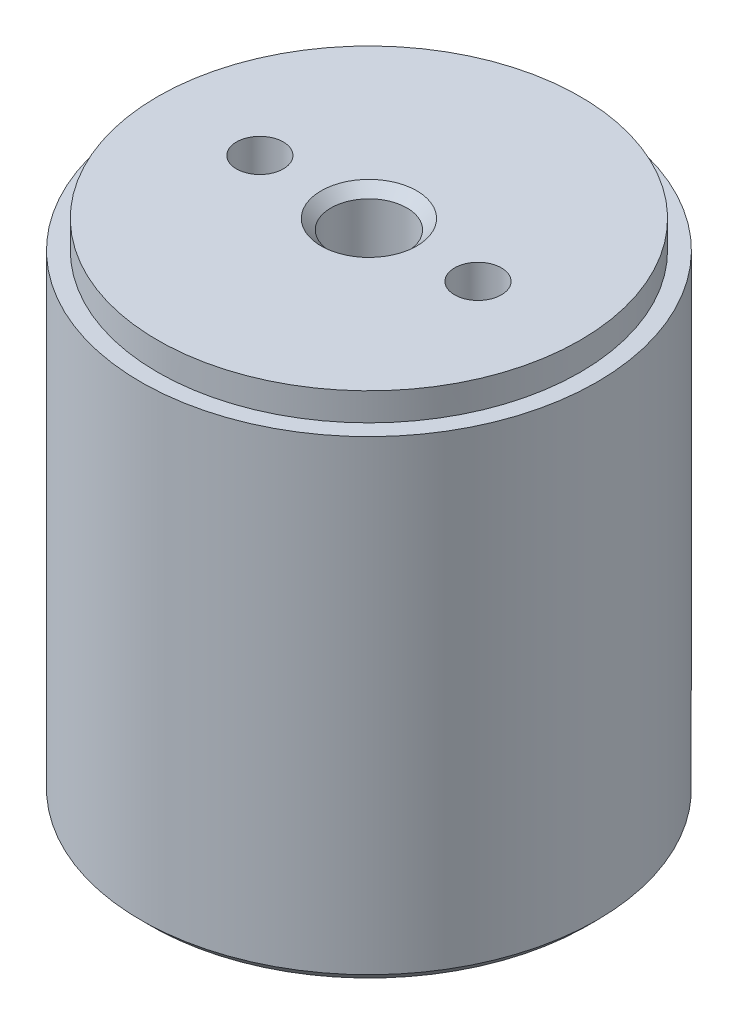
ISO-10303-21;
HEADER;
FILE_DESCRIPTION(('STEP AP214'),'2;1');
FILE_NAME('part.step','',(''),(''),'','','');
FILE_SCHEMA(('AUTOMOTIVE_DESIGN { 1 0 10303 214 1 1 1 1 }'));
ENDSEC;
DATA;
#1=APPLICATION_CONTEXT('core data for automotive mechanical design processes');
#2=APPLICATION_PROTOCOL_DEFINITION('international standard','automotive_design',2000,#1);
#3=PRODUCT_CONTEXT('',#1,'mechanical');
#4=PRODUCT('Part','Part','',(#3));
#5=PRODUCT_RELATED_PRODUCT_CATEGORY('part','',(#4));
#6=PRODUCT_DEFINITION_FORMATION('','',#4);
#7=PRODUCT_DEFINITION_CONTEXT('part definition',#1,'design');
#8=PRODUCT_DEFINITION('design','',#6,#7);
#9=PRODUCT_DEFINITION_SHAPE('','',#8);
#10=(LENGTH_UNIT() NAMED_UNIT(*) SI_UNIT(.MILLI.,.METRE.));
#11=(NAMED_UNIT(*) PLANE_ANGLE_UNIT() SI_UNIT($,.RADIAN.));
#12=(NAMED_UNIT(*) SI_UNIT($,.STERADIAN.) SOLID_ANGLE_UNIT());
#13=UNCERTAINTY_MEASURE_WITH_UNIT(LENGTH_MEASURE(1.E-05),#10,'distance_accuracy_value','');
#14=(GEOMETRIC_REPRESENTATION_CONTEXT(3) GLOBAL_UNCERTAINTY_ASSIGNED_CONTEXT((#13)) GLOBAL_UNIT_ASSIGNED_CONTEXT((#10,
#11,#12)) REPRESENTATION_CONTEXT('',''));
#15=CARTESIAN_POINT('',(0.,0.,0.));
#16=DIRECTION('',(0.,0.,1.));
#17=DIRECTION('',(1.,0.,0.));
#18=AXIS2_PLACEMENT_3D('',#15,#16,#17);
#19=CARTESIAN_POINT('',(0.,0.,0.));
#20=DIRECTION('',(0.,-1.,0.));
#21=DIRECTION('',(0.,0.,-1.));
#22=AXIS2_PLACEMENT_3D('',#19,#20,#21);
#23=PLANE('',#22);
#24=CARTESIAN_POINT('',(0.,0.,0.));
#25=DIRECTION('',(0.,-1.,0.));
#26=DIRECTION('',(0.,0.,-1.));
#27=AXIS2_PLACEMENT_3D('',#24,#25,#26);
#28=CIRCLE('',#27,8.83510678118655);
#29=CARTESIAN_POINT('',(0.,0.,-8.83510678118655));
#30=VERTEX_POINT('',#29);
#31=EDGE_CURVE('E9',#30,#30,#28,.T.);
#32=ORIENTED_EDGE('',*,*,#31,.F.);
#33=EDGE_LOOP('',(#32));
#34=FACE_BOUND('',#33,.T.);
#35=CARTESIAN_POINT('',(0.,0.,0.));
#36=DIRECTION('',(0.,1.,0.));
#37=DIRECTION('',(0.,0.,-1.));
#38=AXIS2_PLACEMENT_3D('',#35,#36,#37);
#39=CIRCLE('',#38,11.);
#40=CARTESIAN_POINT('',(0.,0.,-11.));
#41=VERTEX_POINT('',#40);
#42=EDGE_CURVE('E60',#41,#41,#39,.T.);
#43=ORIENTED_EDGE('',*,*,#42,.F.);
#44=EDGE_LOOP('',(#43));
#45=FACE_BOUND('',#44,.T.);
#46=ADVANCED_FACE('F13',(#34,#45),#23,.T.);
#47=CARTESIAN_POINT('',(0.,25.4,0.));
#48=DIRECTION('',(0.,1.,0.));
#49=DIRECTION('',(0.,0.,1.));
#50=AXIS2_PLACEMENT_3D('',#47,#48,#49);
#51=PLANE('',#50);
#52=CARTESIAN_POINT('',(0.,25.4,0.));
#53=DIRECTION('',(0.,-1.,0.));
#54=DIRECTION('',(1.,0.,0.));
#55=AXIS2_PLACEMENT_3D('',#52,#53,#54);
#56=CIRCLE('',#55,10.65);
#57=CARTESIAN_POINT('',(10.65,25.4,0.));
#58=VERTEX_POINT('',#57);
#59=EDGE_CURVE('E69',#58,#58,#56,.T.);
#60=ORIENTED_EDGE('',*,*,#59,.F.);
#61=EDGE_LOOP('',(#60));
#62=FACE_BOUND('',#61,.T.);
#63=CARTESIAN_POINT('',(5.5,25.4,0.));
#64=DIRECTION('',(0.,1.,0.));
#65=DIRECTION('',(0.,0.,1.));
#66=AXIS2_PLACEMENT_3D('',#63,#64,#65);
#67=CIRCLE('',#66,1.181);
#68=CARTESIAN_POINT('',(5.5,25.4,1.181));
#69=VERTEX_POINT('',#68);
#70=EDGE_CURVE('E51',#69,#69,#67,.T.);
#71=ORIENTED_EDGE('',*,*,#70,.F.);
#72=EDGE_LOOP('',(#71));
#73=FACE_BOUND('',#72,.T.);
#74=CARTESIAN_POINT('',(-5.5,25.4,0.));
#75=DIRECTION('',(0.,1.,0.));
#76=DIRECTION('',(0.,0.,1.));
#77=AXIS2_PLACEMENT_3D('',#74,#75,#76);
#78=CIRCLE('',#77,1.181);
#79=CARTESIAN_POINT('',(-5.5,25.4,1.181));
#80=VERTEX_POINT('',#79);
#81=EDGE_CURVE('E45',#80,#80,#78,.T.);
#82=ORIENTED_EDGE('',*,*,#81,.F.);
#83=EDGE_LOOP('',(#82));
#84=FACE_BOUND('',#83,.T.);
#85=CARTESIAN_POINT('',(0.,25.4,0.));
#86=DIRECTION('',(0.,1.,0.));
#87=DIRECTION('',(0.,0.,-1.));
#88=AXIS2_PLACEMENT_3D('',#85,#86,#87);
#89=CIRCLE('',#88,2.413);
#90=CARTESIAN_POINT('',(0.,25.4,-2.413));
#91=VERTEX_POINT('',#90);
#92=EDGE_CURVE('E117',#91,#91,#89,.T.);
#93=ORIENTED_EDGE('',*,*,#92,.F.);
#94=EDGE_LOOP('',(#93));
#95=FACE_BOUND('',#94,.T.);
#96=ADVANCED_FACE('F126',(#62,#73,#84,#95),#51,.T.);
#97=CARTESIAN_POINT('',(0.,0.5,0.));
#98=DIRECTION('',(0.,1.,0.));
#99=DIRECTION('',(0.,0.,-1.));
#100=AXIS2_PLACEMENT_3D('',#97,#98,#99);
#101=CONICAL_SURFACE('',#100,11.5,0.785398163397449);
#102=ORIENTED_EDGE('',*,*,#42,.T.);
#103=EDGE_LOOP('',(#102));
#104=FACE_BOUND('',#103,.T.);
#105=CARTESIAN_POINT('',(0.,0.5,0.));
#106=DIRECTION('',(0.,1.,0.));
#107=DIRECTION('',(0.,0.,-1.));
#108=AXIS2_PLACEMENT_3D('',#105,#106,#107);
#109=CIRCLE('',#108,11.5);
#110=CARTESIAN_POINT('',(0.,0.499999999999999,-11.5));
#111=VERTEX_POINT('',#110);
#112=EDGE_CURVE('E81',#111,#111,#109,.T.);
#113=ORIENTED_EDGE('',*,*,#112,.F.);
#114=EDGE_LOOP('',(#113));
#115=FACE_BOUND('',#114,.T.);
#116=ADVANCED_FACE('F128',(#104,#115),#101,.T.);
#117=CARTESIAN_POINT('',(0.,10.,0.));
#118=DIRECTION('',(0.,1.,0.));
#119=DIRECTION('',(1.,0.,0.));
#120=AXIS2_PLACEMENT_3D('',#117,#118,#119);
#121=CYLINDRICAL_SURFACE('',#120,10.65);
#122=CARTESIAN_POINT('',(0.,24.,0.));
#123=DIRECTION('',(0.,1.,0.));
#124=DIRECTION('',(0.,0.,1.));
#125=AXIS2_PLACEMENT_3D('',#122,#123,#124);
#126=CIRCLE('',#125,10.65);
#127=CARTESIAN_POINT('',(0.,24.,10.65));
#128=VERTEX_POINT('',#127);
#129=EDGE_CURVE('E44',#128,#128,#126,.T.);
#130=ORIENTED_EDGE('',*,*,#129,.T.);
#131=EDGE_LOOP('',(#130));
#132=FACE_BOUND('',#131,.T.);
#133=ORIENTED_EDGE('',*,*,#59,.T.);
#134=EDGE_LOOP('',(#133));
#135=FACE_BOUND('',#134,.T.);
#136=ADVANCED_FACE('F137',(#132,#135),#121,.T.);
#137=CARTESIAN_POINT('',(0.,24.,0.));
#138=DIRECTION('',(0.,1.,0.));
#139=DIRECTION('',(0.,0.,1.));
#140=AXIS2_PLACEMENT_3D('',#137,#138,#139);
#141=PLANE('',#140);
#142=ORIENTED_EDGE('',*,*,#129,.F.);
#143=EDGE_LOOP('',(#142));
#144=FACE_BOUND('',#143,.T.);
#145=CARTESIAN_POINT('',(0.,24.,0.));
#146=DIRECTION('',(0.,-1.,0.));
#147=DIRECTION('',(1.,0.,0.));
#148=AXIS2_PLACEMENT_3D('',#145,#146,#147);
#149=CIRCLE('',#148,11.5);
#150=CARTESIAN_POINT('',(11.5,24.,0.));
#151=VERTEX_POINT('',#150);
#152=EDGE_CURVE('E65',#151,#151,#149,.T.);
#153=ORIENTED_EDGE('',*,*,#152,.F.);
#154=EDGE_LOOP('',(#153));
#155=FACE_BOUND('',#154,.T.);
#156=ADVANCED_FACE('F150',(#144,#155),#141,.T.);
#157=CARTESIAN_POINT('',(0.,0.,0.));
#158=DIRECTION('',(0.,1.,0.));
#159=DIRECTION('',(1.,0.,0.));
#160=AXIS2_PLACEMENT_3D('',#157,#158,#159);
#161=CYLINDRICAL_SURFACE('',#160,11.5);
#162=ORIENTED_EDGE('',*,*,#152,.T.);
#163=EDGE_LOOP('',(#162));
#164=FACE_BOUND('',#163,.T.);
#165=ORIENTED_EDGE('',*,*,#112,.T.);
#166=EDGE_LOOP('',(#165));
#167=FACE_BOUND('',#166,.T.);
#168=ADVANCED_FACE('F15',(#164,#167),#161,.T.);
#169=CARTESIAN_POINT('',(5.5,20.4,0.));
#170=DIRECTION('',(0.,-1.,0.));
#171=DIRECTION('',(0.,0.,-1.));
#172=AXIS2_PLACEMENT_3D('',#169,#170,#171);
#173=PLANE('',#172);
#174=CARTESIAN_POINT('',(5.5,20.4,0.));
#175=DIRECTION('',(0.,1.,0.));
#176=DIRECTION('',(1.,0.,0.));
#177=AXIS2_PLACEMENT_3D('',#174,#175,#176);
#178=CIRCLE('',#177,1.181);
#179=CARTESIAN_POINT('',(6.681,20.4,0.));
#180=VERTEX_POINT('',#179);
#181=EDGE_CURVE('E49',#180,#180,#178,.T.);
#182=ORIENTED_EDGE('',*,*,#181,.T.);
#183=EDGE_LOOP('',(#182));
#184=FACE_BOUND('',#183,.T.);
#185=ADVANCED_FACE('F161',(#184),#173,.F.);
#186=CARTESIAN_POINT('',(5.5,20.4,0.));
#187=DIRECTION('',(0.,1.,0.));
#188=DIRECTION('',(1.,0.,0.));
#189=AXIS2_PLACEMENT_3D('',#186,#187,#188);
#190=CYLINDRICAL_SURFACE('',#189,1.181);
#191=ORIENTED_EDGE('',*,*,#70,.T.);
#192=EDGE_LOOP('',(#191));
#193=FACE_BOUND('',#192,.T.);
#194=ORIENTED_EDGE('',*,*,#181,.F.);
#195=EDGE_LOOP('',(#194));
#196=FACE_BOUND('',#195,.T.);
#197=ADVANCED_FACE('F174',(#193,#196),#190,.F.);
#198=CARTESIAN_POINT('',(-5.5,20.4,0.));
#199=DIRECTION('',(0.,-1.,0.));
#200=DIRECTION('',(0.,0.,-1.));
#201=AXIS2_PLACEMENT_3D('',#198,#199,#200);
#202=PLANE('',#201);
#203=CARTESIAN_POINT('',(-5.5,20.4,0.));
#204=DIRECTION('',(0.,1.,0.));
#205=DIRECTION('',(1.,0.,0.));
#206=AXIS2_PLACEMENT_3D('',#203,#204,#205);
#207=CIRCLE('',#206,1.181);
#208=CARTESIAN_POINT('',(-4.319,20.4,0.));
#209=VERTEX_POINT('',#208);
#210=EDGE_CURVE('E50',#209,#209,#207,.T.);
#211=ORIENTED_EDGE('',*,*,#210,.T.);
#212=EDGE_LOOP('',(#211));
#213=FACE_BOUND('',#212,.T.);
#214=ADVANCED_FACE('F181',(#213),#202,.F.);
#215=CARTESIAN_POINT('',(-5.5,20.4,0.));
#216=DIRECTION('',(0.,1.,0.));
#217=DIRECTION('',(1.,0.,0.));
#218=AXIS2_PLACEMENT_3D('',#215,#216,#217);
#219=CYLINDRICAL_SURFACE('',#218,1.181);
#220=ORIENTED_EDGE('',*,*,#81,.T.);
#221=EDGE_LOOP('',(#220));
#222=FACE_BOUND('',#221,.T.);
#223=ORIENTED_EDGE('',*,*,#210,.F.);
#224=EDGE_LOOP('',(#223));
#225=FACE_BOUND('',#224,.T.);
#226=ADVANCED_FACE('F185',(#222,#225),#219,.F.);
#227=CARTESIAN_POINT('',(0.,20.4,0.));
#228=DIRECTION('',(0.,1.,0.));
#229=DIRECTION('',(0.,0.,-1.));
#230=AXIS2_PLACEMENT_3D('',#227,#228,#229);
#231=PLANE('',#230);
#232=CARTESIAN_POINT('',(0.,20.4,0.));
#233=DIRECTION('',(0.,1.,0.));
#234=DIRECTION('',(0.,0.,-1.));
#235=AXIS2_PLACEMENT_3D('',#232,#233,#234);
#236=CIRCLE('',#235,1.915);
#237=CARTESIAN_POINT('',(0.,20.4,-1.915));
#238=VERTEX_POINT('',#237);
#239=EDGE_CURVE('E110',#238,#238,#236,.T.);
#240=ORIENTED_EDGE('',*,*,#239,.T.);
#241=EDGE_LOOP('',(#240));
#242=FACE_BOUND('',#241,.T.);
#243=ADVANCED_FACE('F248',(#242),#231,.T.);
#244=CARTESIAN_POINT('',(0.,25.4,0.));
#245=DIRECTION('',(0.,1.,0.));
#246=DIRECTION('',(0.,0.,-1.));
#247=AXIS2_PLACEMENT_3D('',#244,#245,#246);
#248=CYLINDRICAL_SURFACE('',#247,1.915);
#249=CARTESIAN_POINT('',(0.,24.902,0.));
#250=DIRECTION('',(0.,1.,0.));
#251=DIRECTION('',(0.,0.,-1.));
#252=AXIS2_PLACEMENT_3D('',#249,#250,#251);
#253=CIRCLE('',#252,1.915);
#254=CARTESIAN_POINT('',(0.,24.902,-1.915));
#255=VERTEX_POINT('',#254);
#256=EDGE_CURVE('E114',#255,#255,#253,.T.);
#257=ORIENTED_EDGE('',*,*,#256,.T.);
#258=EDGE_LOOP('',(#257));
#259=FACE_BOUND('',#258,.T.);
#260=ORIENTED_EDGE('',*,*,#239,.F.);
#261=EDGE_LOOP('',(#260));
#262=FACE_BOUND('',#261,.T.);
#263=ADVANCED_FACE('F245',(#259,#262),#248,.F.);
#264=CARTESIAN_POINT('',(0.,24.902,0.));
#265=DIRECTION('',(0.,1.,0.));
#266=DIRECTION('',(0.,0.,-1.));
#267=AXIS2_PLACEMENT_3D('',#264,#265,#266);
#268=CONICAL_SURFACE('',#267,1.915,0.785398163397449);
#269=ORIENTED_EDGE('',*,*,#92,.T.);
#270=EDGE_LOOP('',(#269));
#271=FACE_BOUND('',#270,.T.);
#272=ORIENTED_EDGE('',*,*,#256,.F.);
#273=EDGE_LOOP('',(#272));
#274=FACE_BOUND('',#273,.T.);
#275=ADVANCED_FACE('F123',(#271,#274),#268,.F.);
#276=CARTESIAN_POINT('',(0.,0.25,0.));
#277=DIRECTION('',(0.,1.,0.));
#278=DIRECTION('',(1.,0.,0.));
#279=AXIS2_PLACEMENT_3D('',#276,#277,#278);
#280=TOROIDAL_SURFACE('',#279,8.128,0.75);
#281=ORIENTED_EDGE('',*,*,#31,.T.);
#282=EDGE_LOOP('',(#281));
#283=FACE_BOUND('',#282,.T.);
#284=CARTESIAN_POINT('',(0.,0.,0.));
#285=DIRECTION('',(0.,1.,0.));
#286=DIRECTION('',(0.,0.,1.));
#287=AXIS2_PLACEMENT_3D('',#284,#285,#286);
#288=CIRCLE('',#287,7.42089321881345);
#289=CARTESIAN_POINT('',(0.,0.,7.42089321881345));
#290=VERTEX_POINT('',#289);
#291=EDGE_CURVE('E21',#290,#290,#288,.T.);
#292=ORIENTED_EDGE('',*,*,#291,.T.);
#293=EDGE_LOOP('',(#292));
#294=FACE_BOUND('',#293,.T.);
#295=ADVANCED_FACE('F209',(#283,#294),#280,.T.);
#296=CARTESIAN_POINT('',(0.,5.,0.));
#297=DIRECTION('',(0.,1.,0.));
#298=DIRECTION('',(0.,0.,1.));
#299=AXIS2_PLACEMENT_3D('',#296,#297,#298);
#300=PLANE('',#299);
#301=CARTESIAN_POINT('',(0.,5.,0.));
#302=DIRECTION('',(0.,-1.,0.));
#303=DIRECTION('',(1.,0.,0.));
#304=AXIS2_PLACEMENT_3D('',#301,#302,#303);
#305=CIRCLE('',#304,1.181);
#306=CARTESIAN_POINT('',(1.181,5.,0.));
#307=VERTEX_POINT('',#306);
#308=EDGE_CURVE('E61',#307,#307,#305,.T.);
#309=ORIENTED_EDGE('',*,*,#308,.T.);
#310=EDGE_LOOP('',(#309));
#311=FACE_BOUND('',#310,.T.);
#312=ADVANCED_FACE('F205',(#311),#300,.F.);
#313=CARTESIAN_POINT('',(0.,-6.,0.));
#314=DIRECTION('',(0.,1.,0.));
#315=DIRECTION('',(1.,0.,0.));
#316=AXIS2_PLACEMENT_3D('',#313,#314,#315);
#317=CYLINDRICAL_SURFACE('',#316,1.181);
#318=CARTESIAN_POINT('',(0.,-4.,0.));
#319=DIRECTION('',(0.,-1.,0.));
#320=DIRECTION('',(0.,0.,-1.));
#321=AXIS2_PLACEMENT_3D('',#318,#319,#320);
#322=CIRCLE('',#321,1.181);
#323=CARTESIAN_POINT('',(0.,-4.,-1.181));
#324=VERTEX_POINT('',#323);
#325=EDGE_CURVE('E56',#324,#324,#322,.T.);
#326=ORIENTED_EDGE('',*,*,#325,.T.);
#327=EDGE_LOOP('',(#326));
#328=FACE_BOUND('',#327,.T.);
#329=ORIENTED_EDGE('',*,*,#308,.F.);
#330=EDGE_LOOP('',(#329));
#331=FACE_BOUND('',#330,.T.);
#332=ADVANCED_FACE('F208',(#328,#331),#317,.F.);
#333=CARTESIAN_POINT('',(0.,-4.,0.));
#334=DIRECTION('',(0.,-1.,0.));
#335=DIRECTION('',(0.,0.,-1.));
#336=AXIS2_PLACEMENT_3D('',#333,#334,#335);
#337=PLANE('',#336);
#338=ORIENTED_EDGE('',*,*,#325,.F.);
#339=EDGE_LOOP('',(#338));
#340=FACE_BOUND('',#339,.T.);
#341=CARTESIAN_POINT('',(0.,-4.,0.));
#342=DIRECTION('',(0.,1.,0.));
#343=DIRECTION('',(0.,0.,-1.));
#344=AXIS2_PLACEMENT_3D('',#341,#342,#343);
#345=CIRCLE('',#344,1.915);
#346=CARTESIAN_POINT('',(0.,-4.,-1.915));
#347=VERTEX_POINT('',#346);
#348=EDGE_CURVE('E77',#347,#347,#345,.T.);
#349=ORIENTED_EDGE('',*,*,#348,.F.);
#350=EDGE_LOOP('',(#349));
#351=FACE_BOUND('',#350,.T.);
#352=ADVANCED_FACE('F212',(#340,#351),#337,.T.);
#353=CARTESIAN_POINT('',(0.,-3.502,0.));
#354=DIRECTION('',(0.,1.,0.));
#355=DIRECTION('',(0.,0.,-1.));
#356=AXIS2_PLACEMENT_3D('',#353,#354,#355);
#357=CONICAL_SURFACE('',#356,2.413,0.785398163397449);
#358=ORIENTED_EDGE('',*,*,#348,.T.);
#359=EDGE_LOOP('',(#358));
#360=FACE_BOUND('',#359,.T.);
#361=CARTESIAN_POINT('',(0.,-3.502,0.));
#362=DIRECTION('',(0.,1.,0.));
#363=DIRECTION('',(0.,0.,-1.));
#364=AXIS2_PLACEMENT_3D('',#361,#362,#363);
#365=CIRCLE('',#364,2.413);
#366=CARTESIAN_POINT('',(0.,-3.502,-2.413));
#367=VERTEX_POINT('',#366);
#368=EDGE_CURVE('E73',#367,#367,#365,.T.);
#369=ORIENTED_EDGE('',*,*,#368,.F.);
#370=EDGE_LOOP('',(#369));
#371=FACE_BOUND('',#370,.T.);
#372=ADVANCED_FACE('F200',(#360,#371),#357,.T.);
#373=CARTESIAN_POINT('',(5.5,5.,0.));
#374=DIRECTION('',(0.,1.,0.));
#375=DIRECTION('',(0.,0.,1.));
#376=AXIS2_PLACEMENT_3D('',#373,#374,#375);
#377=PLANE('',#376);
#378=CARTESIAN_POINT('',(5.5,5.,0.));
#379=DIRECTION('',(0.,-1.,0.));
#380=DIRECTION('',(1.,0.,0.));
#381=AXIS2_PLACEMENT_3D('',#378,#379,#380);
#382=CIRCLE('',#381,1.181);
#383=CARTESIAN_POINT('',(6.681,5.,0.));
#384=VERTEX_POINT('',#383);
#385=EDGE_CURVE('E89',#384,#384,#382,.T.);
#386=ORIENTED_EDGE('',*,*,#385,.T.);
#387=EDGE_LOOP('',(#386));
#388=FACE_BOUND('',#387,.T.);
#389=ADVANCED_FACE('F191',(#388),#377,.F.);
#390=CARTESIAN_POINT('',(-5.5,5.,0.));
#391=DIRECTION('',(0.,1.,0.));
#392=DIRECTION('',(0.,0.,1.));
#393=AXIS2_PLACEMENT_3D('',#390,#391,#392);
#394=PLANE('',#393);
#395=CARTESIAN_POINT('',(-5.5,5.,0.));
#396=DIRECTION('',(0.,-1.,0.));
#397=DIRECTION('',(1.,0.,0.));
#398=AXIS2_PLACEMENT_3D('',#395,#396,#397);
#399=CIRCLE('',#398,1.181);
#400=CARTESIAN_POINT('',(-4.319,5.,0.));
#401=VERTEX_POINT('',#400);
#402=EDGE_CURVE('E97',#401,#401,#399,.T.);
#403=ORIENTED_EDGE('',*,*,#402,.T.);
#404=EDGE_LOOP('',(#403));
#405=FACE_BOUND('',#404,.T.);
#406=ADVANCED_FACE('F188',(#405),#394,.F.);
#407=CARTESIAN_POINT('',(0.,1.,0.));
#408=DIRECTION('',(0.,-1.,0.));
#409=DIRECTION('',(-1.,0.,0.));
#410=AXIS2_PLACEMENT_3D('',#407,#408,#409);
#411=CYLINDRICAL_SURFACE('',#410,2.413);
#412=CARTESIAN_POINT('',(0.,-0.324609432571377,0.));
#413=DIRECTION('',(0.,1.,0.));
#414=DIRECTION('',(0.,0.,1.));
#415=AXIS2_PLACEMENT_3D('',#412,#413,#414);
#416=CIRCLE('',#415,2.413);
#417=CARTESIAN_POINT('',(0.,-0.324609432571377,2.413));
#418=VERTEX_POINT('',#417);
#419=EDGE_CURVE('E38',#418,#418,#416,.T.);
#420=ORIENTED_EDGE('',*,*,#419,.F.);
#421=EDGE_LOOP('',(#420));
#422=FACE_BOUND('',#421,.T.);
#423=ORIENTED_EDGE('',*,*,#368,.T.);
#424=EDGE_LOOP('',(#423));
#425=FACE_BOUND('',#424,.T.);
#426=ADVANCED_FACE('F147',(#422,#425),#411,.T.);
#427=CARTESIAN_POINT('',(5.5,0.,0.));
#428=DIRECTION('',(0.,1.,0.));
#429=DIRECTION('',(1.,0.,0.));
#430=AXIS2_PLACEMENT_3D('',#427,#428,#429);
#431=CYLINDRICAL_SURFACE('',#430,1.181);
#432=ORIENTED_EDGE('',*,*,#385,.F.);
#433=EDGE_LOOP('',(#432));
#434=FACE_BOUND('',#433,.T.);
#435=CARTESIAN_POINT('',(5.5,0.,0.));
#436=DIRECTION('',(0.,1.,0.));
#437=DIRECTION('',(1.,0.,0.));
#438=AXIS2_PLACEMENT_3D('',#435,#436,#437);
#439=CIRCLE('',#438,1.181);
#440=CARTESIAN_POINT('',(6.681,0.,0.));
#441=VERTEX_POINT('',#440);
#442=EDGE_CURVE('E93',#441,#441,#439,.T.);
#443=ORIENTED_EDGE('',*,*,#442,.F.);
#444=EDGE_LOOP('',(#443));
#445=FACE_BOUND('',#444,.T.);
#446=ADVANCED_FACE('F196',(#434,#445),#431,.F.);
#447=CARTESIAN_POINT('',(-5.5,0.,0.));
#448=DIRECTION('',(0.,1.,0.));
#449=DIRECTION('',(1.,0.,0.));
#450=AXIS2_PLACEMENT_3D('',#447,#448,#449);
#451=CYLINDRICAL_SURFACE('',#450,1.181);
#452=ORIENTED_EDGE('',*,*,#402,.F.);
#453=EDGE_LOOP('',(#452));
#454=FACE_BOUND('',#453,.T.);
#455=CARTESIAN_POINT('',(-5.5,0.,0.));
#456=DIRECTION('',(0.,1.,0.));
#457=DIRECTION('',(1.,0.,0.));
#458=AXIS2_PLACEMENT_3D('',#455,#456,#457);
#459=CIRCLE('',#458,1.181);
#460=CARTESIAN_POINT('',(-4.319,0.,0.));
#461=VERTEX_POINT('',#460);
#462=EDGE_CURVE('E55',#461,#461,#459,.T.);
#463=ORIENTED_EDGE('',*,*,#462,.F.);
#464=EDGE_LOOP('',(#463));
#465=FACE_BOUND('',#464,.T.);
#466=ADVANCED_FACE('F193',(#454,#465),#451,.F.);
#467=CARTESIAN_POINT('',(0.,0.25,0.));
#468=DIRECTION('',(0.,1.,0.));
#469=DIRECTION('',(1.,0.,0.));
#470=AXIS2_PLACEMENT_3D('',#467,#468,#469);
#471=TOROIDAL_SURFACE('',#470,2.895,0.75);
#472=CARTESIAN_POINT('',(0.,0.,0.));
#473=DIRECTION('',(0.,-1.,0.));
#474=DIRECTION('',(0.,0.,-1.));
#475=AXIS2_PLACEMENT_3D('',#472,#473,#474);
#476=CIRCLE('',#475,3.60210678118655);
#477=CARTESIAN_POINT('',(0.,0.,-3.60210678118655));
#478=VERTEX_POINT('',#477);
#479=EDGE_CURVE('E30',#478,#478,#476,.T.);
#480=ORIENTED_EDGE('',*,*,#479,.T.);
#481=EDGE_LOOP('',(#480));
#482=FACE_BOUND('',#481,.T.);
#483=ORIENTED_EDGE('',*,*,#419,.T.);
#484=EDGE_LOOP('',(#483));
#485=FACE_BOUND('',#484,.T.);
#486=ADVANCED_FACE('F153',(#482,#485),#471,.T.);
#487=ORIENTED_EDGE('',*,*,#291,.F.);
#488=EDGE_LOOP('',(#487));
#489=FACE_BOUND('',#488,.T.);
#490=ORIENTED_EDGE('',*,*,#479,.F.);
#491=EDGE_LOOP('',(#490));
#492=FACE_BOUND('',#491,.T.);
#493=ORIENTED_EDGE('',*,*,#462,.T.);
#494=EDGE_LOOP('',(#493));
#495=FACE_BOUND('',#494,.T.);
#496=ORIENTED_EDGE('',*,*,#442,.T.);
#497=EDGE_LOOP('',(#496));
#498=FACE_BOUND('',#497,.T.);
#499=ADVANCED_FACE('F142',(#489,#492,#495,#498),#23,.T.);
#500=CLOSED_SHELL('',(#46,#96,#116,#136,#156,#168,#185,#197,#214,#226,#243,#263,#275,#295,#312,
#332,#352,#372,#389,#406,#426,#446,#466,#486,#499));
#501=MANIFOLD_SOLID_BREP('B1',#500);
#502=ADVANCED_BREP_SHAPE_REPRESENTATION('',(#18,#501),#14);
#503=SHAPE_DEFINITION_REPRESENTATION(#9,#502);
ENDSEC;
END-ISO-10303-21;
